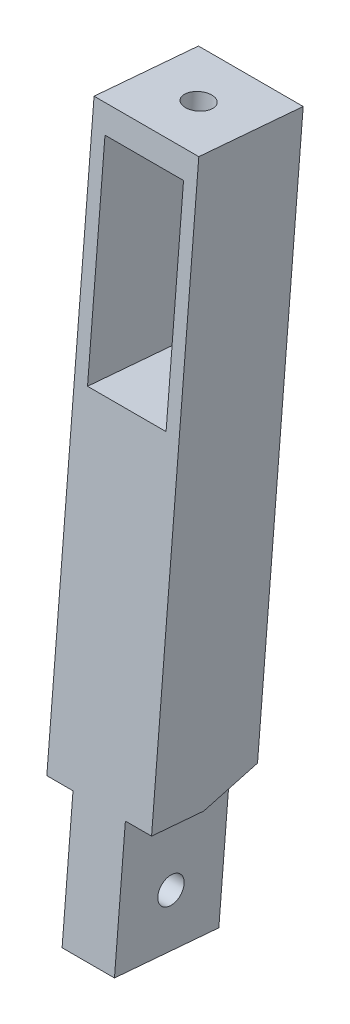
ISO-10303-21;
HEADER;
FILE_DESCRIPTION(('STEP AP214'),'2;1');
FILE_NAME('part.step','',(''),(''),'','','');
FILE_SCHEMA(('AUTOMOTIVE_DESIGN { 1 0 10303 214 1 1 1 1 }'));
ENDSEC;
DATA;
#1=APPLICATION_CONTEXT('core data for automotive mechanical design processes');
#2=APPLICATION_PROTOCOL_DEFINITION('international standard','automotive_design',2000,#1);
#3=PRODUCT_CONTEXT('',#1,'mechanical');
#4=PRODUCT('Part','Part','',(#3));
#5=PRODUCT_RELATED_PRODUCT_CATEGORY('part','',(#4));
#6=PRODUCT_DEFINITION_FORMATION('','',#4);
#7=PRODUCT_DEFINITION_CONTEXT('part definition',#1,'design');
#8=PRODUCT_DEFINITION('design','',#6,#7);
#9=PRODUCT_DEFINITION_SHAPE('','',#8);
#10=(LENGTH_UNIT() NAMED_UNIT(*) SI_UNIT(.MILLI.,.METRE.));
#11=(NAMED_UNIT(*) PLANE_ANGLE_UNIT() SI_UNIT($,.RADIAN.));
#12=(NAMED_UNIT(*) SI_UNIT($,.STERADIAN.) SOLID_ANGLE_UNIT());
#13=UNCERTAINTY_MEASURE_WITH_UNIT(LENGTH_MEASURE(1.E-05),#10,'distance_accuracy_value','');
#14=(GEOMETRIC_REPRESENTATION_CONTEXT(3) GLOBAL_UNCERTAINTY_ASSIGNED_CONTEXT((#13)) GLOBAL_UNIT_ASSIGNED_CONTEXT((#10,
#11,#12)) REPRESENTATION_CONTEXT('',''));
#15=CARTESIAN_POINT('',(0.,0.,0.));
#16=DIRECTION('',(0.,0.,1.));
#17=DIRECTION('',(1.,0.,0.));
#18=AXIS2_PLACEMENT_3D('',#15,#16,#17);
#19=CARTESIAN_POINT('',(6.35000000000001,8.42139640978393,100.667762922524));
#20=DIRECTION('',(1.,0.,0.));
#21=DIRECTION('',(0.,1.,0.));
#22=AXIS2_PLACEMENT_3D('',#19,#20,#21);
#23=PLANE('',#22);
#24=DIRECTION('',(0.,0.0833641530862132,0.996519150834653));
#25=VECTOR('',#24,1.);
#26=CARTESIAN_POINT('',(6.35000000000001,-12.5065251568249,102.418495415516));
#27=LINE('',#26,#25);
#28=CARTESIAN_POINT('',(6.35000000000001,-11.9771627847275,108.746392023316));
#29=VERTEX_POINT('',#28);
#30=CARTESIAN_POINT('',(6.35000000000001,-11.44780041263,115.074288631116));
#31=VERTEX_POINT('',#30);
#32=EDGE_CURVE('E133',#29,#31,#27,.T.);
#33=ORIENTED_EDGE('',*,*,#32,.F.);
#34=DIRECTION('',(0.,0.262492943302061,-0.964933912097933));
#35=VECTOR('',#34,1.);
#36=CARTESIAN_POINT('',(6.35000000000001,-10.2033591460716,102.225823268932));
#37=LINE('',#36,#35);
#38=CARTESIAN_POINT('',(6.35000000000001,-10.2033591460716,102.225823268932));
#39=VERTEX_POINT('',#38);
#40=EDGE_CURVE('E202',#29,#39,#37,.T.);
#41=ORIENTED_EDGE('',*,*,#40,.T.);
#42=DIRECTION('',(0.,0.996519150834653,-0.0833641530862133));
#43=VECTOR('',#42,1.);
#44=CARTESIAN_POINT('',(6.35000000000001,8.42139640978393,100.667762922524));
#45=LINE('',#44,#43);
#46=CARTESIAN_POINT('',(6.35,55.9792534842866,96.6892939946656));
#47=VERTEX_POINT('',#46);
#48=EDGE_CURVE('E165',#39,#47,#45,.T.);
#49=ORIENTED_EDGE('',*,*,#48,.T.);
#50=DIRECTION('',(0.,0.0833641530862132,0.996519150834653));
#51=VECTOR('',#50,1.);
#52=CARTESIAN_POINT('',(6.35,55.9792534842866,96.6892939946656));
#53=LINE('',#52,#51);
#54=CARTESIAN_POINT('',(6.35,57.0379782284815,109.345087210266));
#55=VERTEX_POINT('',#54);
#56=EDGE_CURVE('E136',#47,#55,#53,.T.);
#57=ORIENTED_EDGE('',*,*,#56,.T.);
#58=DIRECTION('',(0.,0.996519150834653,-0.0833641530862133));
#59=VECTOR('',#58,1.);
#60=CARTESIAN_POINT('',(6.35000000000001,9.48012115397884,113.323556138124));
#61=LINE('',#60,#59);
#62=EDGE_CURVE('E145',#31,#55,#61,.T.);
#63=ORIENTED_EDGE('',*,*,#62,.F.);
#64=EDGE_LOOP('',(#33,#41,#49,#57,#63));
#65=FACE_BOUND('',#64,.T.);
#66=ADVANCED_FACE('F39',(#65),#23,.T.);
#67=CARTESIAN_POINT('',(0.,8.42139640978393,100.667762922524));
#68=DIRECTION('',(0.,0.0833641530862133,0.996519150834653));
#69=DIRECTION('',(0.,-0.996519150834653,0.0833641530862133));
#70=AXIS2_PLACEMENT_3D('',#67,#68,#69);
#71=PLANE('',#70);
#72=DIRECTION('',(1.,0.,0.));
#73=VECTOR('',#72,1.);
#74=CARTESIAN_POINT('',(0.,27.5037187491864,99.0714246691041));
#75=LINE('',#74,#73);
#76=CARTESIAN_POINT('',(-4.76249999999998,27.5037187491864,99.0714246691041));
#77=VERTEX_POINT('',#76);
#78=CARTESIAN_POINT('',(4.7625,27.5037187491864,99.0714246691041));
#79=VERTEX_POINT('',#78);
#80=EDGE_CURVE('E144',#77,#79,#75,.T.);
#81=ORIENTED_EDGE('',*,*,#80,.T.);
#82=DIRECTION('',(0.,0.996519150834653,-0.0833641530862133));
#83=VECTOR('',#82,1.);
#84=CARTESIAN_POINT('',(4.7625,8.42139640978393,100.667762922524));
#85=LINE('',#84,#83);
#86=CARTESIAN_POINT('',(4.76250000000001,52.8153051803866,96.9539751807143));
#87=VERTEX_POINT('',#86);
#88=EDGE_CURVE('E171',#79,#87,#85,.T.);
#89=ORIENTED_EDGE('',*,*,#88,.T.);
#90=DIRECTION('',(-1.,0.,0.));
#91=VECTOR('',#90,1.);
#92=CARTESIAN_POINT('',(0.,52.8153051803866,96.9539751807143));
#93=LINE('',#92,#91);
#94=CARTESIAN_POINT('',(-4.76249999999999,52.8153051803866,96.9539751807143));
#95=VERTEX_POINT('',#94);
#96=EDGE_CURVE('E174',#87,#95,#93,.T.);
#97=ORIENTED_EDGE('',*,*,#96,.T.);
#98=DIRECTION('',(0.,-0.996519150834653,0.0833641530862133));
#99=VECTOR('',#98,1.);
#100=CARTESIAN_POINT('',(-4.76249999999997,8.42139640978393,100.667762922524));
#101=LINE('',#100,#99);
#102=EDGE_CURVE('E177',#95,#77,#101,.T.);
#103=ORIENTED_EDGE('',*,*,#102,.T.);
#104=EDGE_LOOP('',(#81,#89,#97,#103));
#105=FACE_BOUND('',#104,.T.);
#106=DIRECTION('',(1.,0.,0.));
#107=VECTOR('',#106,1.);
#108=CARTESIAN_POINT('',(3.17500000000001,-10.2033591460716,102.225823268932));
#109=LINE('',#108,#107);
#110=CARTESIAN_POINT('',(3.17500000000001,-10.2033591460716,102.225823268932));
#111=VERTEX_POINT('',#110);
#112=EDGE_CURVE('E199',#111,#39,#109,.T.);
#113=ORIENTED_EDGE('',*,*,#112,.F.);
#114=DIRECTION('',(0.,0.996519150834653,-0.083364153086213));
#115=VECTOR('',#114,1.);
#116=CARTESIAN_POINT('',(3.17500000000001,-28.3262666763251,103.741901345759));
#117=LINE('',#116,#115);
#118=CARTESIAN_POINT('',(3.17500000000001,-28.3262666763251,103.741901345759));
#119=VERTEX_POINT('',#118);
#120=EDGE_CURVE('E109',#119,#111,#117,.T.);
#121=ORIENTED_EDGE('',*,*,#120,.F.);
#122=DIRECTION('',(1.,0.,0.));
#123=VECTOR('',#122,1.);
#124=CARTESIAN_POINT('',(-3.17499999999999,-28.3262666763251,103.741901345759));
#125=LINE('',#124,#123);
#126=CARTESIAN_POINT('',(-3.17499999999999,-28.3262666763251,103.741901345759));
#127=VERTEX_POINT('',#126);
#128=EDGE_CURVE('E107',#127,#119,#125,.T.);
#129=ORIENTED_EDGE('',*,*,#128,.F.);
#130=DIRECTION('',(0.,-0.996519150834653,0.083364153086213));
#131=VECTOR('',#130,1.);
#132=CARTESIAN_POINT('',(-3.17499999999999,-12.5065251568249,102.418495415516));
#133=LINE('',#132,#131);
#134=CARTESIAN_POINT('',(-3.17499999999999,-10.2033591460716,102.225823268932));
#135=VERTEX_POINT('',#134);
#136=EDGE_CURVE('E91',#135,#127,#133,.T.);
#137=ORIENTED_EDGE('',*,*,#136,.F.);
#138=DIRECTION('',(-1.,0.,0.));
#139=VECTOR('',#138,1.);
#140=CARTESIAN_POINT('',(-3.17499999999999,-10.2033591460716,102.225823268932));
#141=LINE('',#140,#139);
#142=CARTESIAN_POINT('',(-6.34999999999999,-10.2033591460716,102.225823268932));
#143=VERTEX_POINT('',#142);
#144=EDGE_CURVE('E185',#135,#143,#141,.T.);
#145=ORIENTED_EDGE('',*,*,#144,.T.);
#146=DIRECTION('',(0.,-0.996519150834653,0.0833641530862133));
#147=VECTOR('',#146,1.);
#148=CARTESIAN_POINT('',(-6.34999999999998,8.42139640978393,100.667762922524));
#149=LINE('',#148,#147);
#150=CARTESIAN_POINT('',(-6.34999999999997,55.9792534842866,96.6892939946656));
#151=VERTEX_POINT('',#150);
#152=EDGE_CURVE('E168',#151,#143,#149,.T.);
#153=ORIENTED_EDGE('',*,*,#152,.F.);
#154=DIRECTION('',(-1.,0.,0.));
#155=VECTOR('',#154,1.);
#156=CARTESIAN_POINT('',(0.,55.9792534842866,96.6892939946656));
#157=LINE('',#156,#155);
#158=EDGE_CURVE('E121',#47,#151,#157,.T.);
#159=ORIENTED_EDGE('',*,*,#158,.F.);
#160=ORIENTED_EDGE('',*,*,#48,.F.);
#161=EDGE_LOOP('',(#113,#121,#129,#137,#145,#153,#159,#160));
#162=FACE_BOUND('',#161,.T.);
#163=ADVANCED_FACE('F277',(#105,#162),#71,.F.);
#164=CARTESIAN_POINT('',(0.,-12.5065251568249,102.418495415516));
#165=DIRECTION('',(0.,-0.996519150834653,0.0833641530862132));
#166=DIRECTION('',(0.,-0.0833641530862132,-0.996519150834653));
#167=AXIS2_PLACEMENT_3D('',#164,#165,#166);
#168=PLANE('',#167);
#169=DIRECTION('',(0.,0.0833641530862132,0.996519150834653));
#170=VECTOR('',#169,1.);
#171=CARTESIAN_POINT('',(3.17500000000001,-12.5065251568249,102.418495415516));
#172=LINE('',#171,#170);
#173=CARTESIAN_POINT('',(3.17500000000001,-11.9771627847275,108.746392023316));
#174=VERTEX_POINT('',#173);
#175=CARTESIAN_POINT('',(3.17500000000001,-11.44780041263,115.074288631116));
#176=VERTEX_POINT('',#175);
#177=EDGE_CURVE('E11',#174,#176,#172,.T.);
#178=ORIENTED_EDGE('',*,*,#177,.F.);
#179=DIRECTION('',(1.,0.,0.));
#180=VECTOR('',#179,1.);
#181=CARTESIAN_POINT('',(3.17500000000001,-11.9771627847275,108.746392023316));
#182=LINE('',#181,#180);
#183=EDGE_CURVE('E195',#174,#29,#182,.T.);
#184=ORIENTED_EDGE('',*,*,#183,.T.);
#185=ORIENTED_EDGE('',*,*,#32,.T.);
#186=DIRECTION('',(1.,0.,0.));
#187=VECTOR('',#186,1.);
#188=CARTESIAN_POINT('',(0.,-11.44780041263,115.074288631116));
#189=LINE('',#188,#187);
#190=EDGE_CURVE('E149',#176,#31,#189,.T.);
#191=ORIENTED_EDGE('',*,*,#190,.F.);
#192=EDGE_LOOP('',(#178,#184,#185,#191));
#193=FACE_BOUND('',#192,.T.);
#194=ADVANCED_FACE('F288',(#193),#168,.T.);
#195=CARTESIAN_POINT('',(0.,55.9792534842866,96.6892939946656));
#196=DIRECTION('',(0.,0.996519150834653,-0.0833641530862132));
#197=DIRECTION('',(0.,0.0833641530862132,0.996519150834653));
#198=AXIS2_PLACEMENT_3D('',#195,#196,#197);
#199=PLANE('',#198);
#200=CARTESIAN_POINT('',(0.,56.508615856384,103.017190602466));
#201=DIRECTION('',(0.,0.996519150834653,-0.0833641530862132));
#202=DIRECTION('',(0.,0.0833641530862132,0.996519150834653));
#203=AXIS2_PLACEMENT_3D('',#200,#201,#202);
#204=CIRCLE('',#203,1.59999999999999);
#205=CARTESIAN_POINT('',(0.,56.641998501322,104.611621243801));
#206=VERTEX_POINT('',#205);
#207=EDGE_CURVE('E205',#206,#206,#204,.T.);
#208=ORIENTED_EDGE('',*,*,#207,.F.);
#209=EDGE_LOOP('',(#208));
#210=FACE_BOUND('',#209,.T.);
#211=DIRECTION('',(-1.,0.,0.));
#212=VECTOR('',#211,1.);
#213=CARTESIAN_POINT('',(0.,57.0379782284815,109.345087210266));
#214=LINE('',#213,#212);
#215=CARTESIAN_POINT('',(-6.34999999999997,57.0379782284815,109.345087210266));
#216=VERTEX_POINT('',#215);
#217=EDGE_CURVE('E141',#55,#216,#214,.T.);
#218=ORIENTED_EDGE('',*,*,#217,.F.);
#219=ORIENTED_EDGE('',*,*,#56,.F.);
#220=ORIENTED_EDGE('',*,*,#158,.T.);
#221=DIRECTION('',(0.,0.0833641530862132,0.996519150834653));
#222=VECTOR('',#221,1.);
#223=CARTESIAN_POINT('',(-6.34999999999997,55.9792534842866,96.6892939946656));
#224=LINE('',#223,#222);
#225=EDGE_CURVE('E113',#151,#216,#224,.T.);
#226=ORIENTED_EDGE('',*,*,#225,.T.);
#227=EDGE_LOOP('',(#218,#219,#220,#226));
#228=FACE_BOUND('',#227,.T.);
#229=ADVANCED_FACE('F281',(#210,#228),#199,.T.);
#230=CARTESIAN_POINT('',(-4.76249999999997,8.42139640978393,100.667762922524));
#231=DIRECTION('',(-1.,0.,0.));
#232=DIRECTION('',(0.,-1.,0.));
#233=AXIS2_PLACEMENT_3D('',#230,#231,#232);
#234=PLANE('',#233);
#235=DIRECTION('',(0.,-0.996519150834653,0.0833641530862133));
#236=VECTOR('',#235,1.);
#237=CARTESIAN_POINT('',(-4.76249999999997,9.48012115397883,113.323556138124));
#238=LINE('',#237,#236);
#239=CARTESIAN_POINT('',(-4.76249999999999,53.8740299245815,109.609768396314));
#240=VERTEX_POINT('',#239);
#241=CARTESIAN_POINT('',(-4.76249999999998,28.5624434933813,111.727217884704));
#242=VERTEX_POINT('',#241);
#243=EDGE_CURVE('E158',#240,#242,#238,.T.);
#244=ORIENTED_EDGE('',*,*,#243,.T.);
#245=DIRECTION('',(0.,0.0833641530862132,0.996519150834653));
#246=VECTOR('',#245,1.);
#247=CARTESIAN_POINT('',(-4.76249999999998,27.5037187491864,99.0714246691041));
#248=LINE('',#247,#246);
#249=EDGE_CURVE('E117',#77,#242,#248,.T.);
#250=ORIENTED_EDGE('',*,*,#249,.F.);
#251=ORIENTED_EDGE('',*,*,#102,.F.);
#252=DIRECTION('',(0.,0.0833641530862132,0.996519150834653));
#253=VECTOR('',#252,1.);
#254=CARTESIAN_POINT('',(-4.76249999999999,52.8153051803866,96.9539751807143));
#255=LINE('',#254,#253);
#256=EDGE_CURVE('E120',#95,#240,#255,.T.);
#257=ORIENTED_EDGE('',*,*,#256,.T.);
#258=EDGE_LOOP('',(#244,#250,#251,#257));
#259=FACE_BOUND('',#258,.T.);
#260=ADVANCED_FACE('F219',(#259),#234,.F.);
#261=CARTESIAN_POINT('',(0.,52.8153051803866,96.9539751807143));
#262=DIRECTION('',(0.,0.996519150834653,-0.0833641530862132));
#263=DIRECTION('',(0.,0.0833641530862132,0.996519150834653));
#264=AXIS2_PLACEMENT_3D('',#261,#262,#263);
#265=PLANE('',#264);
#266=CARTESIAN_POINT('',(0.,53.344667552484,103.281871788514));
#267=DIRECTION('',(0.,-0.996519150834653,0.0833641530862132));
#268=DIRECTION('',(0.,-0.0833641530862132,-0.996519150834653));
#269=AXIS2_PLACEMENT_3D('',#266,#267,#268);
#270=CIRCLE('',#269,1.59999999999999);
#271=CARTESIAN_POINT('',(0.,53.2112849075461,101.687441147179));
#272=VERTEX_POINT('',#271);
#273=EDGE_CURVE('E209',#272,#272,#270,.T.);
#274=ORIENTED_EDGE('',*,*,#273,.F.);
#275=EDGE_LOOP('',(#274));
#276=FACE_BOUND('',#275,.T.);
#277=DIRECTION('',(-1.,0.,0.));
#278=VECTOR('',#277,1.);
#279=CARTESIAN_POINT('',(0.,53.8740299245815,109.609768396314));
#280=LINE('',#279,#278);
#281=CARTESIAN_POINT('',(4.76250000000001,53.8740299245815,109.609768396314));
#282=VERTEX_POINT('',#281);
#283=EDGE_CURVE('E155',#282,#240,#280,.T.);
#284=ORIENTED_EDGE('',*,*,#283,.T.);
#285=ORIENTED_EDGE('',*,*,#256,.F.);
#286=ORIENTED_EDGE('',*,*,#96,.F.);
#287=DIRECTION('',(0.,0.0833641530862132,0.996519150834653));
#288=VECTOR('',#287,1.);
#289=CARTESIAN_POINT('',(4.76250000000001,52.8153051803866,96.9539751807143));
#290=LINE('',#289,#288);
#291=EDGE_CURVE('E124',#87,#282,#290,.T.);
#292=ORIENTED_EDGE('',*,*,#291,.T.);
#293=EDGE_LOOP('',(#284,#285,#286,#292));
#294=FACE_BOUND('',#293,.T.);
#295=ADVANCED_FACE('F215',(#276,#294),#265,.F.);
#296=CARTESIAN_POINT('',(4.7625,8.42139640978393,100.667762922524));
#297=DIRECTION('',(1.,0.,0.));
#298=DIRECTION('',(0.,1.,0.));
#299=AXIS2_PLACEMENT_3D('',#296,#297,#298);
#300=PLANE('',#299);
#301=DIRECTION('',(0.,0.996519150834653,-0.0833641530862133));
#302=VECTOR('',#301,1.);
#303=CARTESIAN_POINT('',(4.7625,9.48012115397883,113.323556138124));
#304=LINE('',#303,#302);
#305=CARTESIAN_POINT('',(4.7625,28.5624434933813,111.727217884704));
#306=VERTEX_POINT('',#305);
#307=EDGE_CURVE('E152',#306,#282,#304,.T.);
#308=ORIENTED_EDGE('',*,*,#307,.T.);
#309=ORIENTED_EDGE('',*,*,#291,.F.);
#310=ORIENTED_EDGE('',*,*,#88,.F.);
#311=DIRECTION('',(0.,0.0833641530862132,0.996519150834653));
#312=VECTOR('',#311,1.);
#313=CARTESIAN_POINT('',(4.7625,27.5037187491864,99.0714246691041));
#314=LINE('',#313,#312);
#315=EDGE_CURVE('E127',#79,#306,#314,.T.);
#316=ORIENTED_EDGE('',*,*,#315,.T.);
#317=EDGE_LOOP('',(#308,#309,#310,#316));
#318=FACE_BOUND('',#317,.T.);
#319=ADVANCED_FACE('F218',(#318),#300,.F.);
#320=CARTESIAN_POINT('',(0.,27.5037187491864,99.0714246691041));
#321=DIRECTION('',(0.,-0.996519150834653,0.0833641530862132));
#322=DIRECTION('',(0.,-0.0833641530862132,-0.996519150834653));
#323=AXIS2_PLACEMENT_3D('',#320,#321,#322);
#324=PLANE('',#323);
#325=DIRECTION('',(1.,0.,0.));
#326=VECTOR('',#325,1.);
#327=CARTESIAN_POINT('',(0.,28.5624434933813,111.727217884704));
#328=LINE('',#327,#326);
#329=EDGE_CURVE('E95',#242,#306,#328,.T.);
#330=ORIENTED_EDGE('',*,*,#329,.T.);
#331=ORIENTED_EDGE('',*,*,#315,.F.);
#332=ORIENTED_EDGE('',*,*,#80,.F.);
#333=ORIENTED_EDGE('',*,*,#249,.T.);
#334=EDGE_LOOP('',(#330,#331,#332,#333));
#335=FACE_BOUND('',#334,.T.);
#336=ADVANCED_FACE('F240',(#335),#324,.F.);
#337=CARTESIAN_POINT('',(-6.34999999999998,8.42139640978393,100.667762922524));
#338=DIRECTION('',(-1.,0.,0.));
#339=DIRECTION('',(0.,-1.,0.));
#340=AXIS2_PLACEMENT_3D('',#337,#338,#339);
#341=PLANE('',#340);
#342=DIRECTION('',(0.,0.262492943302061,-0.964933912097933));
#343=VECTOR('',#342,1.);
#344=CARTESIAN_POINT('',(-6.34999999999999,-11.9771627847275,108.746392023316));
#345=LINE('',#344,#343);
#346=CARTESIAN_POINT('',(-6.34999999999999,-11.9771627847275,108.746392023316));
#347=VERTEX_POINT('',#346);
#348=EDGE_CURVE('E192',#347,#143,#345,.T.);
#349=ORIENTED_EDGE('',*,*,#348,.F.);
#350=DIRECTION('',(0.,0.0833641530862132,0.996519150834653));
#351=VECTOR('',#350,1.);
#352=CARTESIAN_POINT('',(-6.34999999999999,-12.5065251568249,102.418495415516));
#353=LINE('',#352,#351);
#354=CARTESIAN_POINT('',(-6.34999999999999,-11.44780041263,115.074288631116));
#355=VERTEX_POINT('',#354);
#356=EDGE_CURVE('E130',#347,#355,#353,.T.);
#357=ORIENTED_EDGE('',*,*,#356,.T.);
#358=DIRECTION('',(0.,-0.996519150834653,0.0833641530862133));
#359=VECTOR('',#358,1.);
#360=CARTESIAN_POINT('',(-6.34999999999998,9.48012115397884,113.323556138124));
#361=LINE('',#360,#359);
#362=EDGE_CURVE('E150',#216,#355,#361,.T.);
#363=ORIENTED_EDGE('',*,*,#362,.F.);
#364=ORIENTED_EDGE('',*,*,#225,.F.);
#365=ORIENTED_EDGE('',*,*,#152,.T.);
#366=EDGE_LOOP('',(#349,#357,#363,#364,#365));
#367=FACE_BOUND('',#366,.T.);
#368=ADVANCED_FACE('F273',(#367),#341,.T.);
#369=CARTESIAN_POINT('',(0.,9.48012115397884,113.323556138124));
#370=DIRECTION('',(0.,0.0833641530862133,0.996519150834653));
#371=DIRECTION('',(0.,-0.996519150834653,0.0833641530862133));
#372=AXIS2_PLACEMENT_3D('',#369,#370,#371);
#373=PLANE('',#372);
#374=ORIENTED_EDGE('',*,*,#329,.F.);
#375=ORIENTED_EDGE('',*,*,#243,.F.);
#376=ORIENTED_EDGE('',*,*,#283,.F.);
#377=ORIENTED_EDGE('',*,*,#307,.F.);
#378=EDGE_LOOP('',(#374,#375,#376,#377));
#379=FACE_BOUND('',#378,.T.);
#380=ORIENTED_EDGE('',*,*,#362,.T.);
#381=CARTESIAN_POINT('',(-3.17499999999999,-11.44780041263,115.074288631116));
#382=VERTEX_POINT('',#381);
#383=EDGE_CURVE('E106',#355,#382,#189,.T.);
#384=ORIENTED_EDGE('',*,*,#383,.T.);
#385=DIRECTION('',(0.,-0.996519150834653,0.083364153086213));
#386=VECTOR('',#385,1.);
#387=CARTESIAN_POINT('',(-3.17499999999999,-11.44780041263,115.074288631116));
#388=LINE('',#387,#386);
#389=CARTESIAN_POINT('',(-3.17499999999999,-27.2675419321302,116.397694561359));
#390=VERTEX_POINT('',#389);
#391=EDGE_CURVE('E87',#382,#390,#388,.T.);
#392=ORIENTED_EDGE('',*,*,#391,.T.);
#393=DIRECTION('',(1.,0.,0.));
#394=VECTOR('',#393,1.);
#395=CARTESIAN_POINT('',(-3.17499999999999,-27.2675419321302,116.397694561359));
#396=LINE('',#395,#394);
#397=CARTESIAN_POINT('',(3.17500000000001,-27.2675419321302,116.397694561359));
#398=VERTEX_POINT('',#397);
#399=EDGE_CURVE('E99',#390,#398,#396,.T.);
#400=ORIENTED_EDGE('',*,*,#399,.T.);
#401=DIRECTION('',(0.,0.996519150834653,-0.083364153086213));
#402=VECTOR('',#401,1.);
#403=CARTESIAN_POINT('',(3.17500000000001,-27.2675419321302,116.397694561359));
#404=LINE('',#403,#402);
#405=EDGE_CURVE('E101',#398,#176,#404,.T.);
#406=ORIENTED_EDGE('',*,*,#405,.T.);
#407=ORIENTED_EDGE('',*,*,#190,.T.);
#408=ORIENTED_EDGE('',*,*,#62,.T.);
#409=ORIENTED_EDGE('',*,*,#217,.T.);
#410=EDGE_LOOP('',(#380,#384,#392,#400,#406,#407,#408,#409));
#411=FACE_BOUND('',#410,.T.);
#412=ADVANCED_FACE('F104',(#379,#411),#373,.T.);
#413=DIRECTION('',(-1.,0.,0.));
#414=VECTOR('',#413,1.);
#415=CARTESIAN_POINT('',(-3.17499999999999,-11.9771627847275,108.746392023316));
#416=LINE('',#415,#414);
#417=CARTESIAN_POINT('',(-3.17499999999999,-11.9771627847275,108.746392023316));
#418=VERTEX_POINT('',#417);
#419=EDGE_CURVE('E186',#418,#347,#416,.T.);
#420=ORIENTED_EDGE('',*,*,#419,.F.);
#421=DIRECTION('',(0.,0.0833641530862132,0.996519150834653));
#422=VECTOR('',#421,1.);
#423=CARTESIAN_POINT('',(-3.17499999999999,-12.5065251568249,102.418495415516));
#424=LINE('',#423,#422);
#425=EDGE_CURVE('E48',#418,#382,#424,.T.);
#426=ORIENTED_EDGE('',*,*,#425,.T.);
#427=ORIENTED_EDGE('',*,*,#383,.F.);
#428=ORIENTED_EDGE('',*,*,#356,.F.);
#429=EDGE_LOOP('',(#420,#426,#427,#428));
#430=FACE_BOUND('',#429,.T.);
#431=ADVANCED_FACE('F329',(#430),#168,.T.);
#432=CARTESIAN_POINT('',(-3.17499999999999,-28.3262666763251,103.741901345759));
#433=DIRECTION('',(0.,-0.996519150834653,0.0833641530862132));
#434=DIRECTION('',(0.,-0.0833641530862132,-0.996519150834653));
#435=AXIS2_PLACEMENT_3D('',#432,#433,#434);
#436=PLANE('',#435);
#437=ORIENTED_EDGE('',*,*,#399,.F.);
#438=DIRECTION('',(0.,0.0833641530862132,0.996519150834653));
#439=VECTOR('',#438,1.);
#440=CARTESIAN_POINT('',(-3.17499999999999,-28.3262666763251,103.741901345759));
#441=LINE('',#440,#439);
#442=EDGE_CURVE('E82',#127,#390,#441,.T.);
#443=ORIENTED_EDGE('',*,*,#442,.F.);
#444=ORIENTED_EDGE('',*,*,#128,.T.);
#445=DIRECTION('',(0.,0.0833641530862132,0.996519150834653));
#446=VECTOR('',#445,1.);
#447=CARTESIAN_POINT('',(3.17500000000001,-28.3262666763251,103.741901345759));
#448=LINE('',#447,#446);
#449=EDGE_CURVE('E96',#119,#398,#448,.T.);
#450=ORIENTED_EDGE('',*,*,#449,.T.);
#451=EDGE_LOOP('',(#437,#443,#444,#450));
#452=FACE_BOUND('',#451,.T.);
#453=ADVANCED_FACE('F41',(#452),#436,.T.);
#454=CARTESIAN_POINT('',(-3.17499999999999,-12.5065251568249,102.418495415516));
#455=DIRECTION('',(-1.,0.,0.));
#456=DIRECTION('',(0.,-1.,0.));
#457=AXIS2_PLACEMENT_3D('',#454,#455,#456);
#458=PLANE('',#457);
#459=CARTESIAN_POINT('',(-3.17499999999999,-21.4690076964276,109.540435581462));
#460=DIRECTION('',(-1.,0.,0.));
#461=DIRECTION('',(0.,0.,1.));
#462=AXIS2_PLACEMENT_3D('',#459,#460,#461);
#463=CIRCLE('',#462,1.59999999999999);
#464=CARTESIAN_POINT('',(-3.17499999999999,-21.4690076964276,111.140435581462));
#465=VERTEX_POINT('',#464);
#466=EDGE_CURVE('E182',#465,#465,#463,.T.);
#467=ORIENTED_EDGE('',*,*,#466,.F.);
#468=EDGE_LOOP('',(#467));
#469=FACE_BOUND('',#468,.T.);
#470=ORIENTED_EDGE('',*,*,#391,.F.);
#471=ORIENTED_EDGE('',*,*,#425,.F.);
#472=DIRECTION('',(0.,0.262492943302061,-0.964933912097933));
#473=VECTOR('',#472,1.);
#474=CARTESIAN_POINT('',(-3.17499999999999,-11.9771627847275,108.746392023316));
#475=LINE('',#474,#473);
#476=EDGE_CURVE('E189',#418,#135,#475,.T.);
#477=ORIENTED_EDGE('',*,*,#476,.T.);
#478=ORIENTED_EDGE('',*,*,#136,.T.);
#479=ORIENTED_EDGE('',*,*,#442,.T.);
#480=EDGE_LOOP('',(#470,#471,#477,#478,#479));
#481=FACE_BOUND('',#480,.T.);
#482=ADVANCED_FACE('F84',(#469,#481),#458,.T.);
#483=CARTESIAN_POINT('',(3.17500000000001,-28.3262666763251,103.741901345759));
#484=DIRECTION('',(1.,0.,0.));
#485=DIRECTION('',(0.,1.,0.));
#486=AXIS2_PLACEMENT_3D('',#483,#484,#485);
#487=PLANE('',#486);
#488=CARTESIAN_POINT('',(3.17500000000001,-21.4690076964276,109.540435581462));
#489=DIRECTION('',(1.,0.,0.));
#490=DIRECTION('',(0.,1.,0.));
#491=AXIS2_PLACEMENT_3D('',#488,#489,#490);
#492=CIRCLE('',#491,1.59999999999999);
#493=CARTESIAN_POINT('',(3.17500000000001,-19.8690076964276,109.540435581462));
#494=VERTEX_POINT('',#493);
#495=EDGE_CURVE('E43',#494,#494,#492,.T.);
#496=ORIENTED_EDGE('',*,*,#495,.F.);
#497=EDGE_LOOP('',(#496));
#498=FACE_BOUND('',#497,.T.);
#499=ORIENTED_EDGE('',*,*,#405,.F.);
#500=ORIENTED_EDGE('',*,*,#449,.F.);
#501=ORIENTED_EDGE('',*,*,#120,.T.);
#502=DIRECTION('',(0.,0.262492943302061,-0.964933912097933));
#503=VECTOR('',#502,1.);
#504=CARTESIAN_POINT('',(3.17500000000001,-10.2033591460716,102.225823268932));
#505=LINE('',#504,#503);
#506=EDGE_CURVE('E55',#174,#111,#505,.T.);
#507=ORIENTED_EDGE('',*,*,#506,.F.);
#508=ORIENTED_EDGE('',*,*,#177,.T.);
#509=EDGE_LOOP('',(#499,#500,#501,#507,#508));
#510=FACE_BOUND('',#509,.T.);
#511=ADVANCED_FACE('F305',(#498,#510),#487,.T.);
#512=CARTESIAN_POINT('',(-3.17499999999999,-21.4690076964276,109.540435581462));
#513=DIRECTION('',(-1.,0.,0.));
#514=DIRECTION('',(0.,0.,1.));
#515=AXIS2_PLACEMENT_3D('',#512,#513,#514);
#516=CYLINDRICAL_SURFACE('',#515,1.59999999999999);
#517=ORIENTED_EDGE('',*,*,#495,.T.);
#518=EDGE_LOOP('',(#517));
#519=FACE_BOUND('',#518,.T.);
#520=ORIENTED_EDGE('',*,*,#466,.T.);
#521=EDGE_LOOP('',(#520));
#522=FACE_BOUND('',#521,.T.);
#523=ADVANCED_FACE('F316',(#519,#522),#516,.F.);
#524=CARTESIAN_POINT('',(-3.17499999999999,-11.9771627847275,108.746392023316));
#525=DIRECTION('',(0.,0.964933912097933,0.262492943302061));
#526=DIRECTION('',(0.,-0.262492943302061,0.964933912097933));
#527=AXIS2_PLACEMENT_3D('',#524,#525,#526);
#528=PLANE('',#527);
#529=ORIENTED_EDGE('',*,*,#348,.T.);
#530=ORIENTED_EDGE('',*,*,#144,.F.);
#531=ORIENTED_EDGE('',*,*,#476,.F.);
#532=ORIENTED_EDGE('',*,*,#419,.T.);
#533=EDGE_LOOP('',(#529,#530,#531,#532));
#534=FACE_BOUND('',#533,.T.);
#535=ADVANCED_FACE('F308',(#534),#528,.F.);
#536=CARTESIAN_POINT('',(3.17500000000001,-10.2033591460716,102.225823268932));
#537=DIRECTION('',(0.,-0.964933912097933,-0.262492943302061));
#538=DIRECTION('',(0.,0.262492943302061,-0.964933912097933));
#539=AXIS2_PLACEMENT_3D('',#536,#537,#538);
#540=PLANE('',#539);
#541=ORIENTED_EDGE('',*,*,#40,.F.);
#542=ORIENTED_EDGE('',*,*,#183,.F.);
#543=ORIENTED_EDGE('',*,*,#506,.T.);
#544=ORIENTED_EDGE('',*,*,#112,.T.);
#545=EDGE_LOOP('',(#541,#542,#543,#544));
#546=FACE_BOUND('',#545,.T.);
#547=ADVANCED_FACE('F306',(#546),#540,.T.);
#548=CARTESIAN_POINT('',(0.,53.344667552484,103.281871788514));
#549=DIRECTION('',(0.,-0.996519150834653,0.0833641530862132));
#550=DIRECTION('',(0.,-0.0833641530862132,-0.996519150834653));
#551=AXIS2_PLACEMENT_3D('',#548,#549,#550);
#552=CYLINDRICAL_SURFACE('',#551,1.59999999999999);
#553=ORIENTED_EDGE('',*,*,#207,.T.);
#554=EDGE_LOOP('',(#553));
#555=FACE_BOUND('',#554,.T.);
#556=ORIENTED_EDGE('',*,*,#273,.T.);
#557=EDGE_LOOP('',(#556));
#558=FACE_BOUND('',#557,.T.);
#559=ADVANCED_FACE('F213',(#555,#558),#552,.F.);
#560=CLOSED_SHELL('',(#66,#163,#194,#229,#260,#295,#319,#336,#368,#412,#431,#453,#482,#511,#523,
#535,#547,#559));
#561=MANIFOLD_SOLID_BREP('B2',#560);
#562=ADVANCED_BREP_SHAPE_REPRESENTATION('',(#18,#561),#14);
#563=SHAPE_DEFINITION_REPRESENTATION(#9,#562);
ENDSEC;
END-ISO-10303-21;
